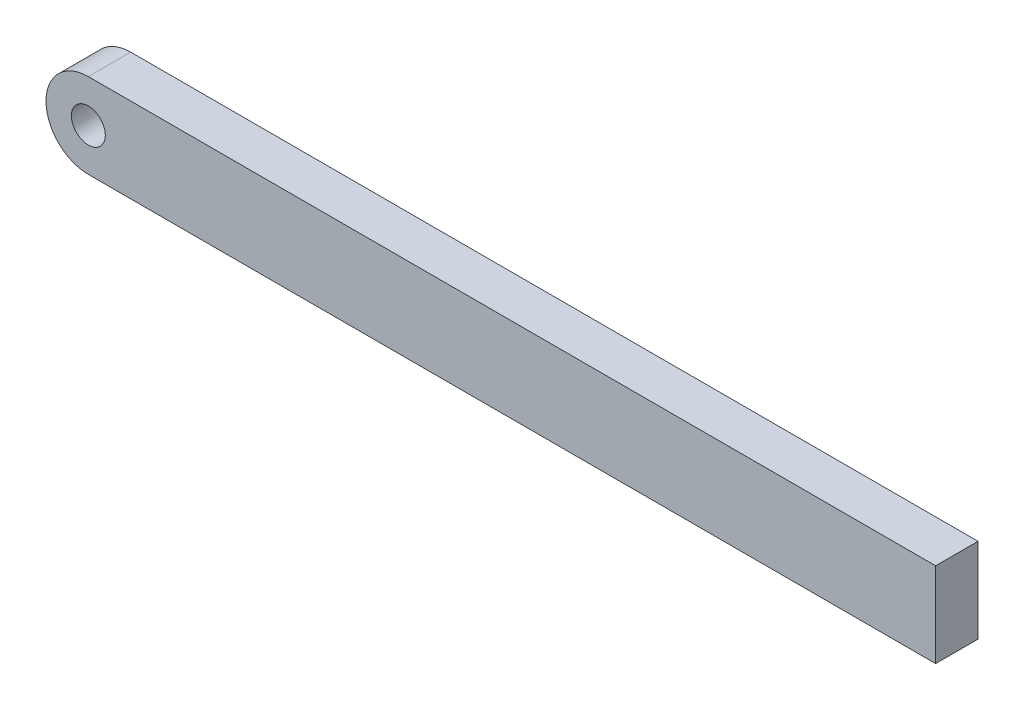
ISO-10303-21;
HEADER;
FILE_DESCRIPTION(('STEP AP214'),'2;1');
FILE_NAME('part.step','',(''),(''),'','','');
FILE_SCHEMA(('AUTOMOTIVE_DESIGN { 1 0 10303 214 1 1 1 1 }'));
ENDSEC;
DATA;
#1=APPLICATION_CONTEXT('core data for automotive mechanical design processes');
#2=APPLICATION_PROTOCOL_DEFINITION('international standard','automotive_design',2000,#1);
#3=PRODUCT_CONTEXT('',#1,'mechanical');
#4=PRODUCT('Part','Part','',(#3));
#5=PRODUCT_RELATED_PRODUCT_CATEGORY('part','',(#4));
#6=PRODUCT_DEFINITION_FORMATION('','',#4);
#7=PRODUCT_DEFINITION_CONTEXT('part definition',#1,'design');
#8=PRODUCT_DEFINITION('design','',#6,#7);
#9=PRODUCT_DEFINITION_SHAPE('','',#8);
#10=(LENGTH_UNIT() NAMED_UNIT(*) SI_UNIT(.MILLI.,.METRE.));
#11=(NAMED_UNIT(*) PLANE_ANGLE_UNIT() SI_UNIT($,.RADIAN.));
#12=(NAMED_UNIT(*) SI_UNIT($,.STERADIAN.) SOLID_ANGLE_UNIT());
#13=UNCERTAINTY_MEASURE_WITH_UNIT(LENGTH_MEASURE(1.E-05),#10,'distance_accuracy_value','');
#14=(GEOMETRIC_REPRESENTATION_CONTEXT(3) GLOBAL_UNCERTAINTY_ASSIGNED_CONTEXT((#13)) GLOBAL_UNIT_ASSIGNED_CONTEXT((#10,
#11,#12)) REPRESENTATION_CONTEXT('',''));
#15=CARTESIAN_POINT('',(0.,0.,0.));
#16=DIRECTION('',(0.,0.,1.));
#17=DIRECTION('',(1.,0.,0.));
#18=AXIS2_PLACEMENT_3D('',#15,#16,#17);
#19=CARTESIAN_POINT('',(0.,0.,50.));
#20=DIRECTION('',(0.,0.,-1.));
#21=DIRECTION('',(-1.,0.,0.));
#22=AXIS2_PLACEMENT_3D('',#19,#20,#21);
#23=CYLINDRICAL_SURFACE('',#22,50.);
#24=CARTESIAN_POINT('',(0.,0.,0.));
#25=DIRECTION('',(0.,0.,1.));
#26=DIRECTION('',(1.,0.,0.));
#27=AXIS2_PLACEMENT_3D('',#24,#25,#26);
#28=CIRCLE('',#27,50.);
#29=CARTESIAN_POINT('',(0.,50.,0.));
#30=VERTEX_POINT('',#29);
#31=CARTESIAN_POINT('',(0.,-50.,0.));
#32=VERTEX_POINT('',#31);
#33=EDGE_CURVE('E107',#30,#32,#28,.T.);
#34=ORIENTED_EDGE('',*,*,#33,.T.);
#35=DIRECTION('',(0.,0.,-1.));
#36=VECTOR('',#35,1.);
#37=CARTESIAN_POINT('',(0.,-50.,50.));
#38=LINE('',#37,#36);
#39=CARTESIAN_POINT('',(0.,-50.,50.));
#40=VERTEX_POINT('',#39);
#41=EDGE_CURVE('E11',#40,#32,#38,.T.);
#42=ORIENTED_EDGE('',*,*,#41,.F.);
#43=CARTESIAN_POINT('',(0.,0.,50.));
#44=DIRECTION('',(0.,0.,1.));
#45=DIRECTION('',(1.,0.,0.));
#46=AXIS2_PLACEMENT_3D('',#43,#44,#45);
#47=CIRCLE('',#46,50.);
#48=CARTESIAN_POINT('',(0.,50.,50.));
#49=VERTEX_POINT('',#48);
#50=EDGE_CURVE('E91',#49,#40,#47,.T.);
#51=ORIENTED_EDGE('',*,*,#50,.F.);
#52=DIRECTION('',(0.,0.,-1.));
#53=VECTOR('',#52,1.);
#54=CARTESIAN_POINT('',(0.,50.,50.));
#55=LINE('',#54,#53);
#56=EDGE_CURVE('E103',#49,#30,#55,.T.);
#57=ORIENTED_EDGE('',*,*,#56,.T.);
#58=EDGE_LOOP('',(#34,#42,#51,#57));
#59=FACE_BOUND('',#58,.T.);
#60=ADVANCED_FACE('F39',(#59),#23,.T.);
#61=CARTESIAN_POINT('',(0.,-50.,50.));
#62=DIRECTION('',(0.,1.,0.));
#63=DIRECTION('',(0.,0.,1.));
#64=AXIS2_PLACEMENT_3D('',#61,#62,#63);
#65=PLANE('',#64);
#66=DIRECTION('',(1.,0.,0.));
#67=VECTOR('',#66,1.);
#68=CARTESIAN_POINT('',(0.,-50.,0.));
#69=LINE('',#68,#67);
#70=CARTESIAN_POINT('',(1000.,-50.,0.));
#71=VERTEX_POINT('',#70);
#72=EDGE_CURVE('E96',#32,#71,#69,.T.);
#73=ORIENTED_EDGE('',*,*,#72,.T.);
#74=DIRECTION('',(0.,0.,-1.));
#75=VECTOR('',#74,1.);
#76=CARTESIAN_POINT('',(1000.,-50.,50.));
#77=LINE('',#76,#75);
#78=CARTESIAN_POINT('',(1000.,-50.,50.));
#79=VERTEX_POINT('',#78);
#80=EDGE_CURVE('E48',#79,#71,#77,.T.);
#81=ORIENTED_EDGE('',*,*,#80,.F.);
#82=DIRECTION('',(1.,0.,0.));
#83=VECTOR('',#82,1.);
#84=CARTESIAN_POINT('',(0.,-50.,50.));
#85=LINE('',#84,#83);
#86=EDGE_CURVE('E86',#40,#79,#85,.T.);
#87=ORIENTED_EDGE('',*,*,#86,.F.);
#88=ORIENTED_EDGE('',*,*,#41,.T.);
#89=EDGE_LOOP('',(#73,#81,#87,#88));
#90=FACE_BOUND('',#89,.T.);
#91=ADVANCED_FACE('F95',(#90),#65,.F.);
#92=CARTESIAN_POINT('',(1000.,50.,50.));
#93=DIRECTION('',(-1.,0.,0.));
#94=DIRECTION('',(0.,0.,1.));
#95=AXIS2_PLACEMENT_3D('',#92,#93,#94);
#96=PLANE('',#95);
#97=DIRECTION('',(0.,1.,0.));
#98=VECTOR('',#97,1.);
#99=CARTESIAN_POINT('',(1000.,50.,0.));
#100=LINE('',#99,#98);
#101=CARTESIAN_POINT('',(1000.,50.,0.));
#102=VERTEX_POINT('',#101);
#103=EDGE_CURVE('E73',#71,#102,#100,.T.);
#104=ORIENTED_EDGE('',*,*,#103,.T.);
#105=DIRECTION('',(0.,0.,-1.));
#106=VECTOR('',#105,1.);
#107=CARTESIAN_POINT('',(1000.,50.,50.));
#108=LINE('',#107,#106);
#109=CARTESIAN_POINT('',(1000.,50.,50.));
#110=VERTEX_POINT('',#109);
#111=EDGE_CURVE('E98',#110,#102,#108,.T.);
#112=ORIENTED_EDGE('',*,*,#111,.F.);
#113=DIRECTION('',(0.,1.,0.));
#114=VECTOR('',#113,1.);
#115=CARTESIAN_POINT('',(1000.,50.,50.));
#116=LINE('',#115,#114);
#117=EDGE_CURVE('E89',#79,#110,#116,.T.);
#118=ORIENTED_EDGE('',*,*,#117,.F.);
#119=ORIENTED_EDGE('',*,*,#80,.T.);
#120=EDGE_LOOP('',(#104,#112,#118,#119));
#121=FACE_BOUND('',#120,.T.);
#122=ADVANCED_FACE('F99',(#121),#96,.F.);
#123=CARTESIAN_POINT('',(0.,50.,50.));
#124=DIRECTION('',(0.,-1.,0.));
#125=DIRECTION('',(0.,0.,-1.));
#126=AXIS2_PLACEMENT_3D('',#123,#124,#125);
#127=PLANE('',#126);
#128=DIRECTION('',(-1.,0.,0.));
#129=VECTOR('',#128,1.);
#130=CARTESIAN_POINT('',(0.,50.,0.));
#131=LINE('',#130,#129);
#132=EDGE_CURVE('E79',#102,#30,#131,.T.);
#133=ORIENTED_EDGE('',*,*,#132,.T.);
#134=ORIENTED_EDGE('',*,*,#56,.F.);
#135=DIRECTION('',(-1.,0.,0.));
#136=VECTOR('',#135,1.);
#137=CARTESIAN_POINT('',(0.,50.,50.));
#138=LINE('',#137,#136);
#139=EDGE_CURVE('E56',#110,#49,#138,.T.);
#140=ORIENTED_EDGE('',*,*,#139,.F.);
#141=ORIENTED_EDGE('',*,*,#111,.T.);
#142=EDGE_LOOP('',(#133,#134,#140,#141));
#143=FACE_BOUND('',#142,.T.);
#144=ADVANCED_FACE('F121',(#143),#127,.F.);
#145=CARTESIAN_POINT('',(0.,0.,50.));
#146=DIRECTION('',(0.,0.,1.));
#147=DIRECTION('',(1.,0.,0.));
#148=AXIS2_PLACEMENT_3D('',#145,#146,#147);
#149=PLANE('',#148);
#150=CARTESIAN_POINT('',(0.,0.,50.));
#151=DIRECTION('',(0.,0.,1.));
#152=DIRECTION('',(1.,0.,0.));
#153=AXIS2_PLACEMENT_3D('',#150,#151,#152);
#154=CIRCLE('',#153,20.);
#155=CARTESIAN_POINT('',(20.,0.,50.));
#156=VERTEX_POINT('',#155);
#157=EDGE_CURVE('E128',#156,#156,#154,.T.);
#158=ORIENTED_EDGE('',*,*,#157,.F.);
#159=EDGE_LOOP('',(#158));
#160=FACE_BOUND('',#159,.T.);
#161=ORIENTED_EDGE('',*,*,#50,.T.);
#162=ORIENTED_EDGE('',*,*,#86,.T.);
#163=ORIENTED_EDGE('',*,*,#117,.T.);
#164=ORIENTED_EDGE('',*,*,#139,.T.);
#165=EDGE_LOOP('',(#161,#162,#163,#164));
#166=FACE_BOUND('',#165,.T.);
#167=ADVANCED_FACE('F87',(#160,#166),#149,.T.);
#168=CARTESIAN_POINT('',(0.,0.,0.));
#169=DIRECTION('',(0.,0.,1.));
#170=DIRECTION('',(1.,0.,0.));
#171=AXIS2_PLACEMENT_3D('',#168,#169,#170);
#172=PLANE('',#171);
#173=ORIENTED_EDGE('',*,*,#33,.F.);
#174=ORIENTED_EDGE('',*,*,#132,.F.);
#175=ORIENTED_EDGE('',*,*,#103,.F.);
#176=ORIENTED_EDGE('',*,*,#72,.F.);
#177=EDGE_LOOP('',(#173,#174,#175,#176));
#178=FACE_BOUND('',#177,.T.);
#179=ADVANCED_FACE('F124',(#178),#172,.F.);
#180=CARTESIAN_POINT('',(0.,0.,20.));
#181=DIRECTION('',(0.,0.,1.));
#182=DIRECTION('',(1.,0.,0.));
#183=AXIS2_PLACEMENT_3D('',#180,#181,#182);
#184=CYLINDRICAL_SURFACE('',#183,20.);
#185=CARTESIAN_POINT('',(0.,0.,20.));
#186=DIRECTION('',(0.,0.,1.));
#187=DIRECTION('',(1.,0.,0.));
#188=AXIS2_PLACEMENT_3D('',#185,#186,#187);
#189=CIRCLE('',#188,20.);
#190=CARTESIAN_POINT('',(20.,0.,20.));
#191=VERTEX_POINT('',#190);
#192=EDGE_CURVE('E111',#191,#191,#189,.T.);
#193=ORIENTED_EDGE('',*,*,#192,.F.);
#194=EDGE_LOOP('',(#193));
#195=FACE_BOUND('',#194,.T.);
#196=ORIENTED_EDGE('',*,*,#157,.T.);
#197=EDGE_LOOP('',(#196));
#198=FACE_BOUND('',#197,.T.);
#199=ADVANCED_FACE('F138',(#195,#198),#184,.F.);
#200=CARTESIAN_POINT('',(0.,0.,20.));
#201=DIRECTION('',(0.,0.,1.));
#202=DIRECTION('',(1.,0.,0.));
#203=AXIS2_PLACEMENT_3D('',#200,#201,#202);
#204=PLANE('',#203);
#205=ORIENTED_EDGE('',*,*,#192,.T.);
#206=EDGE_LOOP('',(#205));
#207=FACE_BOUND('',#206,.T.);
#208=ADVANCED_FACE('F136',(#207),#204,.T.);
#209=CLOSED_SHELL('',(#60,#91,#122,#144,#167,#179,#199,#208));
#210=MANIFOLD_SOLID_BREP('B2',#209);
#211=ADVANCED_BREP_SHAPE_REPRESENTATION('',(#18,#210),#14);
#212=SHAPE_DEFINITION_REPRESENTATION(#9,#211);
ENDSEC;
END-ISO-10303-21;
